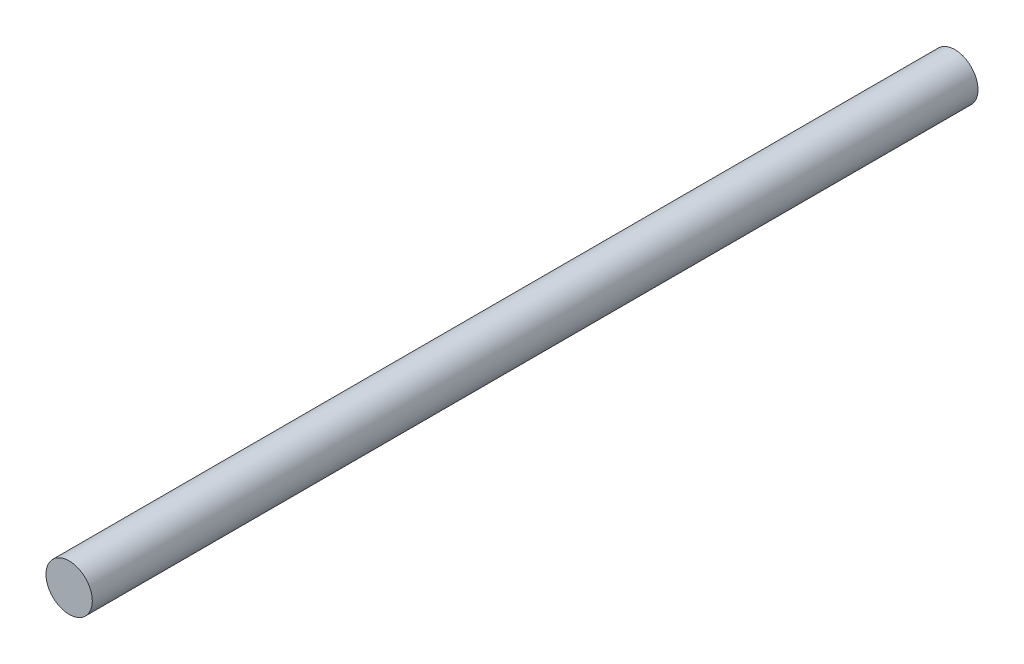
ISO-10303-21;
HEADER;
FILE_DESCRIPTION(('STEP AP214'),'2;1');
FILE_NAME('part.step','',(''),(''),'','','');
FILE_SCHEMA(('AUTOMOTIVE_DESIGN { 1 0 10303 214 1 1 1 1 }'));
ENDSEC;
DATA;
#1=APPLICATION_CONTEXT('core data for automotive mechanical design processes');
#2=APPLICATION_PROTOCOL_DEFINITION('international standard','automotive_design',2000,#1);
#3=PRODUCT_CONTEXT('',#1,'mechanical');
#4=PRODUCT('Part','Part','',(#3));
#5=PRODUCT_RELATED_PRODUCT_CATEGORY('part','',(#4));
#6=PRODUCT_DEFINITION_FORMATION('','',#4);
#7=PRODUCT_DEFINITION_CONTEXT('part definition',#1,'design');
#8=PRODUCT_DEFINITION('design','',#6,#7);
#9=PRODUCT_DEFINITION_SHAPE('','',#8);
#10=(LENGTH_UNIT() NAMED_UNIT(*) SI_UNIT(.MILLI.,.METRE.));
#11=(NAMED_UNIT(*) PLANE_ANGLE_UNIT() SI_UNIT($,.RADIAN.));
#12=(NAMED_UNIT(*) SI_UNIT($,.STERADIAN.) SOLID_ANGLE_UNIT());
#13=UNCERTAINTY_MEASURE_WITH_UNIT(LENGTH_MEASURE(1.E-05),#10,'distance_accuracy_value','');
#14=(GEOMETRIC_REPRESENTATION_CONTEXT(3) GLOBAL_UNCERTAINTY_ASSIGNED_CONTEXT((#13)) GLOBAL_UNIT_ASSIGNED_CONTEXT((#10,
#11,#12)) REPRESENTATION_CONTEXT('',''));
#15=CARTESIAN_POINT('',(0.,0.,0.));
#16=DIRECTION('',(0.,0.,1.));
#17=DIRECTION('',(1.,0.,0.));
#18=AXIS2_PLACEMENT_3D('',#15,#16,#17);
#19=CARTESIAN_POINT('',(0.,0.,152.4));
#20=DIRECTION('',(0.,0.,-1.));
#21=DIRECTION('',(-1.,0.,0.));
#22=AXIS2_PLACEMENT_3D('',#19,#20,#21);
#23=CYLINDRICAL_SURFACE('',#22,3.9878);
#24=CARTESIAN_POINT('',(0.,0.,152.4));
#25=DIRECTION('',(0.,0.,1.));
#26=DIRECTION('',(1.,0.,0.));
#27=AXIS2_PLACEMENT_3D('',#24,#25,#26);
#28=CIRCLE('',#27,3.9878);
#29=CARTESIAN_POINT('',(3.9878,0.,152.4));
#30=VERTEX_POINT('',#29);
#31=EDGE_CURVE('E10',#30,#30,#28,.T.);
#32=ORIENTED_EDGE('',*,*,#31,.F.);
#33=EDGE_LOOP('',(#32));
#34=FACE_BOUND('',#33,.T.);
#35=CARTESIAN_POINT('',(0.,0.,0.));
#36=DIRECTION('',(0.,0.,1.));
#37=DIRECTION('',(1.,0.,0.));
#38=AXIS2_PLACEMENT_3D('',#35,#36,#37);
#39=CIRCLE('',#38,3.9878);
#40=CARTESIAN_POINT('',(3.9878,0.,0.));
#41=VERTEX_POINT('',#40);
#42=EDGE_CURVE('E41',#41,#41,#39,.T.);
#43=ORIENTED_EDGE('',*,*,#42,.T.);
#44=EDGE_LOOP('',(#43));
#45=FACE_BOUND('',#44,.T.);
#46=ADVANCED_FACE('F38',(#34,#45),#23,.T.);
#47=CARTESIAN_POINT('',(0.,0.,152.4));
#48=DIRECTION('',(0.,0.,1.));
#49=DIRECTION('',(1.,0.,0.));
#50=AXIS2_PLACEMENT_3D('',#47,#48,#49);
#51=PLANE('',#50);
#52=ORIENTED_EDGE('',*,*,#31,.T.);
#53=EDGE_LOOP('',(#52));
#54=FACE_BOUND('',#53,.T.);
#55=ADVANCED_FACE('F53',(#54),#51,.T.);
#56=CARTESIAN_POINT('',(0.,0.,0.));
#57=DIRECTION('',(0.,0.,1.));
#58=DIRECTION('',(1.,0.,0.));
#59=AXIS2_PLACEMENT_3D('',#56,#57,#58);
#60=PLANE('',#59);
#61=ORIENTED_EDGE('',*,*,#42,.F.);
#62=EDGE_LOOP('',(#61));
#63=FACE_BOUND('',#62,.T.);
#64=ADVANCED_FACE('F51',(#63),#60,.F.);
#65=CLOSED_SHELL('',(#46,#55,#64));
#66=MANIFOLD_SOLID_BREP('B2',#65);
#67=ADVANCED_BREP_SHAPE_REPRESENTATION('',(#18,#66),#14);
#68=SHAPE_DEFINITION_REPRESENTATION(#9,#67);
ENDSEC;
END-ISO-10303-21;
